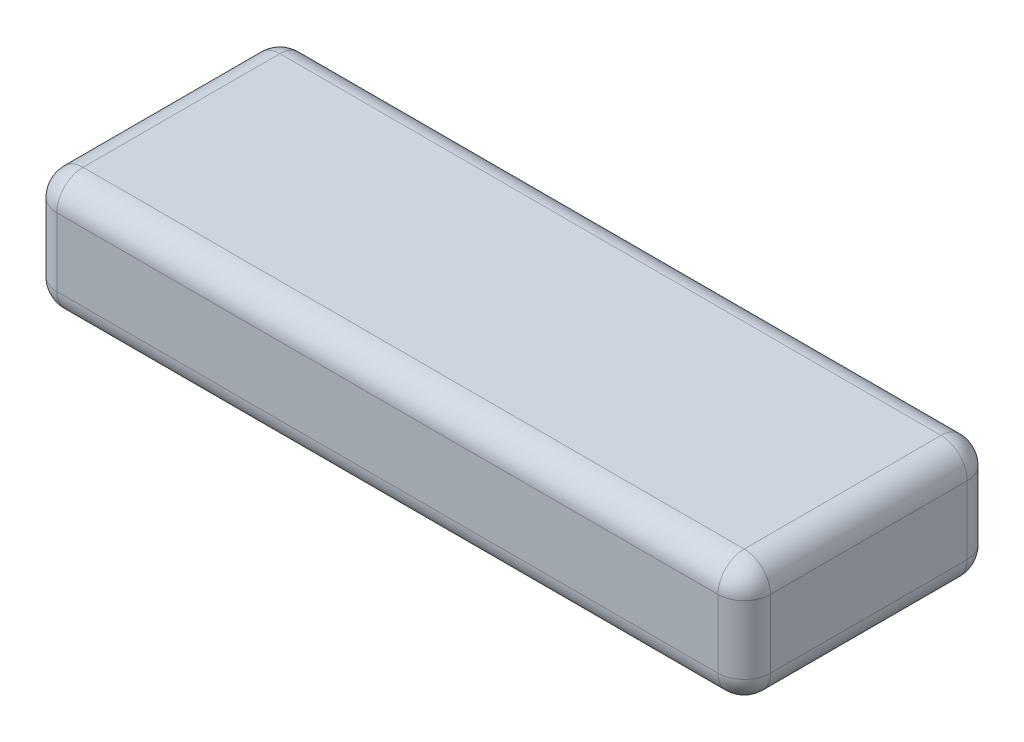
ISO-10303-21;
HEADER;
FILE_DESCRIPTION(('STEP AP214'),'2;1');
FILE_NAME('part.step','',(''),(''),'','','');
FILE_SCHEMA(('AUTOMOTIVE_DESIGN { 1 0 10303 214 1 1 1 1 }'));
ENDSEC;
DATA;
#1=APPLICATION_CONTEXT('core data for automotive mechanical design processes');
#2=APPLICATION_PROTOCOL_DEFINITION('international standard','automotive_design',2000,#1);
#3=PRODUCT_CONTEXT('',#1,'mechanical');
#4=PRODUCT('Part','Part','',(#3));
#5=PRODUCT_RELATED_PRODUCT_CATEGORY('part','',(#4));
#6=PRODUCT_DEFINITION_FORMATION('','',#4);
#7=PRODUCT_DEFINITION_CONTEXT('part definition',#1,'design');
#8=PRODUCT_DEFINITION('design','',#6,#7);
#9=PRODUCT_DEFINITION_SHAPE('','',#8);
#10=(LENGTH_UNIT() NAMED_UNIT(*) SI_UNIT(.MILLI.,.METRE.));
#11=(NAMED_UNIT(*) PLANE_ANGLE_UNIT() SI_UNIT($,.RADIAN.));
#12=(NAMED_UNIT(*) SI_UNIT($,.STERADIAN.) SOLID_ANGLE_UNIT());
#13=UNCERTAINTY_MEASURE_WITH_UNIT(LENGTH_MEASURE(1.E-05),#10,'distance_accuracy_value','');
#14=(GEOMETRIC_REPRESENTATION_CONTEXT(3) GLOBAL_UNCERTAINTY_ASSIGNED_CONTEXT((#13)) GLOBAL_UNIT_ASSIGNED_CONTEXT((#10,
#11,#12)) REPRESENTATION_CONTEXT('',''));
#15=CARTESIAN_POINT('',(0.,0.,0.));
#16=DIRECTION('',(0.,0.,1.));
#17=DIRECTION('',(1.,0.,0.));
#18=AXIS2_PLACEMENT_3D('',#15,#16,#17);
#19=CARTESIAN_POINT('',(-68.,23.,-23.75));
#20=DIRECTION('',(1.,0.,0.));
#21=DIRECTION('',(0.,0.,-1.));
#22=AXIS2_PLACEMENT_3D('',#19,#20,#21);
#23=PLANE('',#22);
#24=DIRECTION('',(0.,-1.,0.));
#25=VECTOR('',#24,1.);
#26=CARTESIAN_POINT('',(-68.,23.,-18.75));
#27=LINE('',#26,#25);
#28=CARTESIAN_POINT('',(-68.,18.,-18.75));
#29=VERTEX_POINT('',#28);
#30=CARTESIAN_POINT('',(-68.,5.,-18.75));
#31=VERTEX_POINT('',#30);
#32=EDGE_CURVE('E136',#29,#31,#27,.T.);
#33=ORIENTED_EDGE('',*,*,#32,.T.);
#34=DIRECTION('',(0.,0.,1.));
#35=VECTOR('',#34,1.);
#36=CARTESIAN_POINT('',(-68.,5.,-23.75));
#37=LINE('',#36,#35);
#38=CARTESIAN_POINT('',(-68.,5.,18.75));
#39=VERTEX_POINT('',#38);
#40=EDGE_CURVE('E132',#31,#39,#37,.T.);
#41=ORIENTED_EDGE('',*,*,#40,.T.);
#42=DIRECTION('',(0.,-1.,0.));
#43=VECTOR('',#42,1.);
#44=CARTESIAN_POINT('',(-68.,23.,18.75));
#45=LINE('',#44,#43);
#46=CARTESIAN_POINT('',(-68.,18.,18.75));
#47=VERTEX_POINT('',#46);
#48=EDGE_CURVE('E127',#39,#47,#45,.F.);
#49=ORIENTED_EDGE('',*,*,#48,.T.);
#50=DIRECTION('',(0.,0.,1.));
#51=VECTOR('',#50,1.);
#52=CARTESIAN_POINT('',(-68.,18.,-23.75));
#53=LINE('',#52,#51);
#54=EDGE_CURVE('E129',#47,#29,#53,.F.);
#55=ORIENTED_EDGE('',*,*,#54,.T.);
#56=EDGE_LOOP('',(#33,#41,#49,#55));
#57=FACE_BOUND('',#56,.T.);
#58=ADVANCED_FACE('F36',(#57),#23,.F.);
#59=CARTESIAN_POINT('',(-68.,23.,23.75));
#60=DIRECTION('',(0.,0.,-1.));
#61=DIRECTION('',(-1.,0.,0.));
#62=AXIS2_PLACEMENT_3D('',#59,#60,#61);
#63=PLANE('',#62);
#64=DIRECTION('',(1.,0.,0.));
#65=VECTOR('',#64,1.);
#66=CARTESIAN_POINT('',(-68.,18.,23.75));
#67=LINE('',#66,#65);
#68=CARTESIAN_POINT('',(63.,18.,23.75));
#69=VERTEX_POINT('',#68);
#70=CARTESIAN_POINT('',(-63.,18.,23.75));
#71=VERTEX_POINT('',#70);
#72=EDGE_CURVE('E232',#69,#71,#67,.F.);
#73=ORIENTED_EDGE('',*,*,#72,.T.);
#74=DIRECTION('',(0.,-1.,0.));
#75=VECTOR('',#74,1.);
#76=CARTESIAN_POINT('',(-63.,23.,23.75));
#77=LINE('',#76,#75);
#78=CARTESIAN_POINT('',(-63.,5.,23.75));
#79=VERTEX_POINT('',#78);
#80=EDGE_CURVE('E159',#71,#79,#77,.T.);
#81=ORIENTED_EDGE('',*,*,#80,.T.);
#82=DIRECTION('',(1.,0.,0.));
#83=VECTOR('',#82,1.);
#84=CARTESIAN_POINT('',(-68.,5.,23.75));
#85=LINE('',#84,#83);
#86=CARTESIAN_POINT('',(63.,5.,23.75));
#87=VERTEX_POINT('',#86);
#88=EDGE_CURVE('E236',#79,#87,#85,.T.);
#89=ORIENTED_EDGE('',*,*,#88,.T.);
#90=DIRECTION('',(0.,-1.,0.));
#91=VECTOR('',#90,1.);
#92=CARTESIAN_POINT('',(63.,23.,23.75));
#93=LINE('',#92,#91);
#94=EDGE_CURVE('E234',#87,#69,#93,.F.);
#95=ORIENTED_EDGE('',*,*,#94,.T.);
#96=EDGE_LOOP('',(#73,#81,#89,#95));
#97=FACE_BOUND('',#96,.T.);
#98=ADVANCED_FACE('F306',(#97),#63,.F.);
#99=CARTESIAN_POINT('',(68.,23.,-23.75));
#100=DIRECTION('',(-1.,0.,0.));
#101=DIRECTION('',(0.,0.,1.));
#102=AXIS2_PLACEMENT_3D('',#99,#100,#101);
#103=PLANE('',#102);
#104=DIRECTION('',(0.,-1.,0.));
#105=VECTOR('',#104,1.);
#106=CARTESIAN_POINT('',(68.,23.,18.75));
#107=LINE('',#106,#105);
#108=CARTESIAN_POINT('',(68.,18.,18.75));
#109=VERTEX_POINT('',#108);
#110=CARTESIAN_POINT('',(68.,5.,18.75));
#111=VERTEX_POINT('',#110);
#112=EDGE_CURVE('E241',#109,#111,#107,.T.);
#113=ORIENTED_EDGE('',*,*,#112,.T.);
#114=DIRECTION('',(0.,0.,-1.));
#115=VECTOR('',#114,1.);
#116=CARTESIAN_POINT('',(68.,5.,-23.75));
#117=LINE('',#116,#115);
#118=CARTESIAN_POINT('',(68.,5.,-18.75));
#119=VERTEX_POINT('',#118);
#120=EDGE_CURVE('E244',#111,#119,#117,.T.);
#121=ORIENTED_EDGE('',*,*,#120,.T.);
#122=DIRECTION('',(0.,-1.,0.));
#123=VECTOR('',#122,1.);
#124=CARTESIAN_POINT('',(68.,23.,-18.75));
#125=LINE('',#124,#123);
#126=CARTESIAN_POINT('',(68.,18.,-18.75));
#127=VERTEX_POINT('',#126);
#128=EDGE_CURVE('E216',#119,#127,#125,.F.);
#129=ORIENTED_EDGE('',*,*,#128,.T.);
#130=DIRECTION('',(0.,0.,-1.));
#131=VECTOR('',#130,1.);
#132=CARTESIAN_POINT('',(68.,18.,23.75));
#133=LINE('',#132,#131);
#134=EDGE_CURVE('E239',#127,#109,#133,.F.);
#135=ORIENTED_EDGE('',*,*,#134,.T.);
#136=EDGE_LOOP('',(#113,#121,#129,#135));
#137=FACE_BOUND('',#136,.T.);
#138=ADVANCED_FACE('F311',(#137),#103,.F.);
#139=CARTESIAN_POINT('',(-68.,23.,-23.75));
#140=DIRECTION('',(0.,0.,1.));
#141=DIRECTION('',(1.,0.,0.));
#142=AXIS2_PLACEMENT_3D('',#139,#140,#141);
#143=PLANE('',#142);
#144=DIRECTION('',(-1.,0.,0.));
#145=VECTOR('',#144,1.);
#146=CARTESIAN_POINT('',(-68.,5.,-23.75));
#147=LINE('',#146,#145);
#148=CARTESIAN_POINT('',(63.,5.,-23.75));
#149=VERTEX_POINT('',#148);
#150=CARTESIAN_POINT('',(-63.,5.,-23.75));
#151=VERTEX_POINT('',#150);
#152=EDGE_CURVE('E221',#149,#151,#147,.T.);
#153=ORIENTED_EDGE('',*,*,#152,.T.);
#154=DIRECTION('',(0.,-1.,0.));
#155=VECTOR('',#154,1.);
#156=CARTESIAN_POINT('',(-63.,23.,-23.75));
#157=LINE('',#156,#155);
#158=CARTESIAN_POINT('',(-63.,18.,-23.75));
#159=VERTEX_POINT('',#158);
#160=EDGE_CURVE('E224',#151,#159,#157,.F.);
#161=ORIENTED_EDGE('',*,*,#160,.T.);
#162=DIRECTION('',(-1.,0.,0.));
#163=VECTOR('',#162,1.);
#164=CARTESIAN_POINT('',(68.,18.,-23.75));
#165=LINE('',#164,#163);
#166=CARTESIAN_POINT('',(63.,18.,-23.75));
#167=VERTEX_POINT('',#166);
#168=EDGE_CURVE('E222',#159,#167,#165,.F.);
#169=ORIENTED_EDGE('',*,*,#168,.T.);
#170=DIRECTION('',(0.,-1.,0.));
#171=VECTOR('',#170,1.);
#172=CARTESIAN_POINT('',(63.,23.,-23.75));
#173=LINE('',#172,#171);
#174=EDGE_CURVE('E218',#167,#149,#173,.T.);
#175=ORIENTED_EDGE('',*,*,#174,.T.);
#176=EDGE_LOOP('',(#153,#161,#169,#175));
#177=FACE_BOUND('',#176,.T.);
#178=ADVANCED_FACE('F292',(#177),#143,.F.);
#179=CARTESIAN_POINT('',(0.,23.,0.));
#180=DIRECTION('',(0.,1.,0.));
#181=DIRECTION('',(0.,0.,1.));
#182=AXIS2_PLACEMENT_3D('',#179,#180,#181);
#183=PLANE('',#182);
#184=DIRECTION('',(1.,0.,0.));
#185=VECTOR('',#184,1.);
#186=CARTESIAN_POINT('',(68.,23.,18.75));
#187=LINE('',#186,#185);
#188=CARTESIAN_POINT('',(-63.,23.,18.75));
#189=VERTEX_POINT('',#188);
#190=CARTESIAN_POINT('',(63.,23.,18.75));
#191=VERTEX_POINT('',#190);
#192=EDGE_CURVE('E45',#189,#191,#187,.T.);
#193=ORIENTED_EDGE('',*,*,#192,.T.);
#194=DIRECTION('',(0.,0.,-1.));
#195=VECTOR('',#194,1.);
#196=CARTESIAN_POINT('',(63.,23.,-23.75));
#197=LINE('',#196,#195);
#198=CARTESIAN_POINT('',(63.,23.,-18.75));
#199=VERTEX_POINT('',#198);
#200=EDGE_CURVE('E11',#191,#199,#197,.T.);
#201=ORIENTED_EDGE('',*,*,#200,.T.);
#202=DIRECTION('',(-1.,0.,0.));
#203=VECTOR('',#202,1.);
#204=CARTESIAN_POINT('',(-68.,23.,-18.75));
#205=LINE('',#204,#203);
#206=CARTESIAN_POINT('',(-63.,23.,-18.75));
#207=VERTEX_POINT('',#206);
#208=EDGE_CURVE('E59',#199,#207,#205,.T.);
#209=ORIENTED_EDGE('',*,*,#208,.T.);
#210=DIRECTION('',(0.,0.,1.));
#211=VECTOR('',#210,1.);
#212=CARTESIAN_POINT('',(-63.,23.,23.75));
#213=LINE('',#212,#211);
#214=EDGE_CURVE('E246',#207,#189,#213,.T.);
#215=ORIENTED_EDGE('',*,*,#214,.T.);
#216=EDGE_LOOP('',(#193,#201,#209,#215));
#217=FACE_BOUND('',#216,.T.);
#218=ADVANCED_FACE('F371',(#217),#183,.T.);
#219=CARTESIAN_POINT('',(0.,0.,0.));
#220=DIRECTION('',(0.,1.,0.));
#221=DIRECTION('',(0.,0.,1.));
#222=AXIS2_PLACEMENT_3D('',#219,#220,#221);
#223=PLANE('',#222);
#224=DIRECTION('',(1.,0.,0.));
#225=VECTOR('',#224,1.);
#226=CARTESIAN_POINT('',(0.,0.,18.75));
#227=LINE('',#226,#225);
#228=CARTESIAN_POINT('',(63.,0.,18.75));
#229=VERTEX_POINT('',#228);
#230=CARTESIAN_POINT('',(-63.,0.,18.75));
#231=VERTEX_POINT('',#230);
#232=EDGE_CURVE('E275',#229,#231,#227,.F.);
#233=ORIENTED_EDGE('',*,*,#232,.T.);
#234=DIRECTION('',(0.,0.,1.));
#235=VECTOR('',#234,1.);
#236=CARTESIAN_POINT('',(-63.,0.,0.));
#237=LINE('',#236,#235);
#238=CARTESIAN_POINT('',(-63.,0.,-18.75));
#239=VERTEX_POINT('',#238);
#240=EDGE_CURVE('E226',#231,#239,#237,.F.);
#241=ORIENTED_EDGE('',*,*,#240,.T.);
#242=DIRECTION('',(-1.,0.,0.));
#243=VECTOR('',#242,1.);
#244=CARTESIAN_POINT('',(0.,0.,-18.75));
#245=LINE('',#244,#243);
#246=CARTESIAN_POINT('',(63.,0.,-18.75));
#247=VERTEX_POINT('',#246);
#248=EDGE_CURVE('E270',#239,#247,#245,.F.);
#249=ORIENTED_EDGE('',*,*,#248,.T.);
#250=DIRECTION('',(0.,0.,-1.));
#251=VECTOR('',#250,1.);
#252=CARTESIAN_POINT('',(63.,0.,0.));
#253=LINE('',#252,#251);
#254=EDGE_CURVE('E285',#247,#229,#253,.F.);
#255=ORIENTED_EDGE('',*,*,#254,.T.);
#256=EDGE_LOOP('',(#233,#241,#249,#255));
#257=FACE_BOUND('',#256,.T.);
#258=ADVANCED_FACE('F278',(#257),#223,.F.);
#259=CARTESIAN_POINT('',(63.,18.,0.));
#260=DIRECTION('',(0.,0.,1.));
#261=DIRECTION('',(1.,0.,0.));
#262=AXIS2_PLACEMENT_3D('',#259,#260,#261);
#263=CYLINDRICAL_SURFACE('',#262,5.);
#264=CARTESIAN_POINT('',(63.,18.,-18.75));
#265=DIRECTION('',(0.,0.,-1.));
#266=DIRECTION('',(-1.,0.,0.));
#267=AXIS2_PLACEMENT_3D('',#264,#265,#266);
#268=CIRCLE('',#267,5.);
#269=EDGE_CURVE('E40',#199,#127,#268,.T.);
#270=ORIENTED_EDGE('',*,*,#269,.F.);
#271=ORIENTED_EDGE('',*,*,#200,.F.);
#272=CARTESIAN_POINT('',(63.,18.,18.75));
#273=DIRECTION('',(0.,0.,1.));
#274=DIRECTION('',(0.,-1.,0.));
#275=AXIS2_PLACEMENT_3D('',#272,#273,#274);
#276=CIRCLE('',#275,5.);
#277=EDGE_CURVE('E198',#109,#191,#276,.T.);
#278=ORIENTED_EDGE('',*,*,#277,.F.);
#279=ORIENTED_EDGE('',*,*,#134,.F.);
#280=EDGE_LOOP('',(#270,#271,#278,#279));
#281=FACE_BOUND('',#280,.T.);
#282=ADVANCED_FACE('F38',(#281),#263,.T.);
#283=CARTESIAN_POINT('',(63.,18.,-18.75));
#284=DIRECTION('',(0.,0.,1.));
#285=DIRECTION('',(1.,0.,0.));
#286=AXIS2_PLACEMENT_3D('',#283,#284,#285);
#287=SPHERICAL_SURFACE('',#286,5.);
#288=CARTESIAN_POINT('',(63.,18.,-18.75));
#289=DIRECTION('',(1.,0.,0.));
#290=DIRECTION('',(0.,0.,-1.));
#291=AXIS2_PLACEMENT_3D('',#288,#289,#290);
#292=CIRCLE('',#291,5.);
#293=EDGE_CURVE('E194',#199,#167,#292,.F.);
#294=ORIENTED_EDGE('',*,*,#293,.F.);
#295=ORIENTED_EDGE('',*,*,#269,.T.);
#296=CARTESIAN_POINT('',(63.,18.,-18.75));
#297=DIRECTION('',(0.,1.,0.));
#298=DIRECTION('',(0.,0.,1.));
#299=AXIS2_PLACEMENT_3D('',#296,#297,#298);
#300=CIRCLE('',#299,5.);
#301=EDGE_CURVE('E196',#167,#127,#300,.F.);
#302=ORIENTED_EDGE('',*,*,#301,.F.);
#303=EDGE_LOOP('',(#294,#295,#302));
#304=FACE_BOUND('',#303,.T.);
#305=ADVANCED_FACE('F208',(#304),#287,.T.);
#306=CARTESIAN_POINT('',(63.,18.,18.75));
#307=DIRECTION('',(0.,0.,1.));
#308=DIRECTION('',(1.,0.,0.));
#309=AXIS2_PLACEMENT_3D('',#306,#307,#308);
#310=SPHERICAL_SURFACE('',#309,5.);
#311=CARTESIAN_POINT('',(63.,18.,18.75));
#312=DIRECTION('',(0.,1.,0.));
#313=DIRECTION('',(0.,0.,1.));
#314=AXIS2_PLACEMENT_3D('',#311,#312,#313);
#315=CIRCLE('',#314,5.);
#316=EDGE_CURVE('E188',#109,#69,#315,.F.);
#317=ORIENTED_EDGE('',*,*,#316,.F.);
#318=ORIENTED_EDGE('',*,*,#277,.T.);
#319=CARTESIAN_POINT('',(63.,18.,18.75));
#320=DIRECTION('',(1.,0.,0.));
#321=DIRECTION('',(0.,0.,-1.));
#322=AXIS2_PLACEMENT_3D('',#319,#320,#321);
#323=CIRCLE('',#322,5.);
#324=EDGE_CURVE('E191',#69,#191,#323,.F.);
#325=ORIENTED_EDGE('',*,*,#324,.F.);
#326=EDGE_LOOP('',(#317,#318,#325));
#327=FACE_BOUND('',#326,.T.);
#328=ADVANCED_FACE('F303',(#327),#310,.T.);
#329=CARTESIAN_POINT('',(63.,23.,-18.75));
#330=DIRECTION('',(0.,-1.,0.));
#331=DIRECTION('',(0.,0.,-1.));
#332=AXIS2_PLACEMENT_3D('',#329,#330,#331);
#333=CYLINDRICAL_SURFACE('',#332,5.);
#334=ORIENTED_EDGE('',*,*,#301,.T.);
#335=ORIENTED_EDGE('',*,*,#128,.F.);
#336=CARTESIAN_POINT('',(63.,5.,-18.75));
#337=DIRECTION('',(0.,-1.,0.));
#338=DIRECTION('',(0.,0.,-1.));
#339=AXIS2_PLACEMENT_3D('',#336,#337,#338);
#340=CIRCLE('',#339,5.);
#341=EDGE_CURVE('E183',#149,#119,#340,.T.);
#342=ORIENTED_EDGE('',*,*,#341,.F.);
#343=ORIENTED_EDGE('',*,*,#174,.F.);
#344=EDGE_LOOP('',(#334,#335,#342,#343));
#345=FACE_BOUND('',#344,.T.);
#346=ADVANCED_FACE('F214',(#345),#333,.T.);
#347=CARTESIAN_POINT('',(0.,18.,-18.75));
#348=DIRECTION('',(1.,0.,0.));
#349=DIRECTION('',(0.,0.,-1.));
#350=AXIS2_PLACEMENT_3D('',#347,#348,#349);
#351=CYLINDRICAL_SURFACE('',#350,5.);
#352=ORIENTED_EDGE('',*,*,#293,.T.);
#353=ORIENTED_EDGE('',*,*,#168,.F.);
#354=CARTESIAN_POINT('',(-63.,18.,-18.75));
#355=DIRECTION('',(-1.,0.,0.));
#356=DIRECTION('',(0.,0.,1.));
#357=AXIS2_PLACEMENT_3D('',#354,#355,#356);
#358=CIRCLE('',#357,5.);
#359=EDGE_CURVE('E180',#207,#159,#358,.T.);
#360=ORIENTED_EDGE('',*,*,#359,.F.);
#361=ORIENTED_EDGE('',*,*,#208,.F.);
#362=EDGE_LOOP('',(#352,#353,#360,#361));
#363=FACE_BOUND('',#362,.T.);
#364=ADVANCED_FACE('F294',(#363),#351,.T.);
#365=CARTESIAN_POINT('',(-63.,18.,0.));
#366=DIRECTION('',(0.,0.,-1.));
#367=DIRECTION('',(-1.,0.,0.));
#368=AXIS2_PLACEMENT_3D('',#365,#366,#367);
#369=CYLINDRICAL_SURFACE('',#368,5.);
#370=CARTESIAN_POINT('',(-63.,18.,18.75));
#371=DIRECTION('',(0.,0.,1.));
#372=DIRECTION('',(1.,0.,0.));
#373=AXIS2_PLACEMENT_3D('',#370,#371,#372);
#374=CIRCLE('',#373,5.);
#375=EDGE_CURVE('E143',#189,#47,#374,.T.);
#376=ORIENTED_EDGE('',*,*,#375,.F.);
#377=ORIENTED_EDGE('',*,*,#214,.F.);
#378=CARTESIAN_POINT('',(-63.,18.,-18.75));
#379=DIRECTION('',(0.,0.,-1.));
#380=DIRECTION('',(-1.,0.,0.));
#381=AXIS2_PLACEMENT_3D('',#378,#379,#380);
#382=CIRCLE('',#381,5.);
#383=EDGE_CURVE('E146',#29,#207,#382,.T.);
#384=ORIENTED_EDGE('',*,*,#383,.F.);
#385=ORIENTED_EDGE('',*,*,#54,.F.);
#386=EDGE_LOOP('',(#376,#377,#384,#385));
#387=FACE_BOUND('',#386,.T.);
#388=ADVANCED_FACE('F141',(#387),#369,.T.);
#389=CARTESIAN_POINT('',(0.,18.,18.75));
#390=DIRECTION('',(-1.,0.,0.));
#391=DIRECTION('',(0.,0.,1.));
#392=AXIS2_PLACEMENT_3D('',#389,#390,#391);
#393=CYLINDRICAL_SURFACE('',#392,5.);
#394=ORIENTED_EDGE('',*,*,#324,.T.);
#395=ORIENTED_EDGE('',*,*,#192,.F.);
#396=CARTESIAN_POINT('',(-63.,18.,18.75));
#397=DIRECTION('',(-1.,0.,0.));
#398=DIRECTION('',(0.,0.,1.));
#399=AXIS2_PLACEMENT_3D('',#396,#397,#398);
#400=CIRCLE('',#399,5.);
#401=EDGE_CURVE('E155',#71,#189,#400,.T.);
#402=ORIENTED_EDGE('',*,*,#401,.F.);
#403=ORIENTED_EDGE('',*,*,#72,.F.);
#404=EDGE_LOOP('',(#394,#395,#402,#403));
#405=FACE_BOUND('',#404,.T.);
#406=ADVANCED_FACE('F301',(#405),#393,.T.);
#407=CARTESIAN_POINT('',(63.,23.,18.75));
#408=DIRECTION('',(0.,-1.,0.));
#409=DIRECTION('',(0.,0.,-1.));
#410=AXIS2_PLACEMENT_3D('',#407,#408,#409);
#411=CYLINDRICAL_SURFACE('',#410,5.);
#412=ORIENTED_EDGE('',*,*,#316,.T.);
#413=ORIENTED_EDGE('',*,*,#94,.F.);
#414=CARTESIAN_POINT('',(63.,5.,18.75));
#415=DIRECTION('',(0.,-1.,0.));
#416=DIRECTION('',(0.,0.,-1.));
#417=AXIS2_PLACEMENT_3D('',#414,#415,#416);
#418=CIRCLE('',#417,5.);
#419=EDGE_CURVE('E175',#111,#87,#418,.T.);
#420=ORIENTED_EDGE('',*,*,#419,.F.);
#421=ORIENTED_EDGE('',*,*,#112,.F.);
#422=EDGE_LOOP('',(#412,#413,#420,#421));
#423=FACE_BOUND('',#422,.T.);
#424=ADVANCED_FACE('F352',(#423),#411,.T.);
#425=CARTESIAN_POINT('',(63.,5.,-23.75));
#426=DIRECTION('',(0.,0.,-1.));
#427=DIRECTION('',(-1.,0.,0.));
#428=AXIS2_PLACEMENT_3D('',#425,#426,#427);
#429=CYLINDRICAL_SURFACE('',#428,5.);
#430=CARTESIAN_POINT('',(63.,5.,-18.75));
#431=DIRECTION('',(0.,0.,-1.));
#432=DIRECTION('',(-1.,0.,0.));
#433=AXIS2_PLACEMENT_3D('',#430,#431,#432);
#434=CIRCLE('',#433,5.);
#435=EDGE_CURVE('E185',#119,#247,#434,.T.);
#436=ORIENTED_EDGE('',*,*,#435,.F.);
#437=ORIENTED_EDGE('',*,*,#120,.F.);
#438=CARTESIAN_POINT('',(63.,5.,18.75));
#439=DIRECTION('',(0.,0.,1.));
#440=DIRECTION('',(1.,0.,0.));
#441=AXIS2_PLACEMENT_3D('',#438,#439,#440);
#442=CIRCLE('',#441,5.);
#443=EDGE_CURVE('E172',#229,#111,#442,.T.);
#444=ORIENTED_EDGE('',*,*,#443,.F.);
#445=ORIENTED_EDGE('',*,*,#254,.F.);
#446=EDGE_LOOP('',(#436,#437,#444,#445));
#447=FACE_BOUND('',#446,.T.);
#448=ADVANCED_FACE('F348',(#447),#429,.T.);
#449=CARTESIAN_POINT('',(63.,5.,-18.75));
#450=DIRECTION('',(0.,0.,1.));
#451=DIRECTION('',(1.,0.,0.));
#452=AXIS2_PLACEMENT_3D('',#449,#450,#451);
#453=SPHERICAL_SURFACE('',#452,5.);
#454=ORIENTED_EDGE('',*,*,#341,.T.);
#455=ORIENTED_EDGE('',*,*,#435,.T.);
#456=CARTESIAN_POINT('',(63.,5.,-18.75));
#457=DIRECTION('',(1.,0.,0.));
#458=DIRECTION('',(0.,0.,-1.));
#459=AXIS2_PLACEMENT_3D('',#456,#457,#458);
#460=CIRCLE('',#459,5.);
#461=EDGE_CURVE('E163',#149,#247,#460,.F.);
#462=ORIENTED_EDGE('',*,*,#461,.F.);
#463=EDGE_LOOP('',(#454,#455,#462));
#464=FACE_BOUND('',#463,.T.);
#465=ADVANCED_FACE('F344',(#464),#453,.T.);
#466=CARTESIAN_POINT('',(-63.,18.,-18.75));
#467=DIRECTION('',(0.,0.,1.));
#468=DIRECTION('',(1.,0.,0.));
#469=AXIS2_PLACEMENT_3D('',#466,#467,#468);
#470=SPHERICAL_SURFACE('',#469,5.);
#471=ORIENTED_EDGE('',*,*,#383,.T.);
#472=ORIENTED_EDGE('',*,*,#359,.T.);
#473=CARTESIAN_POINT('',(-63.,18.,-18.75));
#474=DIRECTION('',(0.,1.,0.));
#475=DIRECTION('',(0.,0.,1.));
#476=AXIS2_PLACEMENT_3D('',#473,#474,#475);
#477=CIRCLE('',#476,5.);
#478=EDGE_CURVE('E160',#29,#159,#477,.F.);
#479=ORIENTED_EDGE('',*,*,#478,.F.);
#480=EDGE_LOOP('',(#471,#472,#479));
#481=FACE_BOUND('',#480,.T.);
#482=ADVANCED_FACE('F341',(#481),#470,.T.);
#483=CARTESIAN_POINT('',(-63.,18.,18.75));
#484=DIRECTION('',(0.,0.,1.));
#485=DIRECTION('',(1.,0.,0.));
#486=AXIS2_PLACEMENT_3D('',#483,#484,#485);
#487=SPHERICAL_SURFACE('',#486,5.);
#488=ORIENTED_EDGE('',*,*,#401,.T.);
#489=ORIENTED_EDGE('',*,*,#375,.T.);
#490=CARTESIAN_POINT('',(-63.,18.,18.75));
#491=DIRECTION('',(0.,1.,0.));
#492=DIRECTION('',(0.,0.,1.));
#493=AXIS2_PLACEMENT_3D('',#490,#491,#492);
#494=CIRCLE('',#493,5.);
#495=EDGE_CURVE('E152',#71,#47,#494,.F.);
#496=ORIENTED_EDGE('',*,*,#495,.F.);
#497=EDGE_LOOP('',(#488,#489,#496));
#498=FACE_BOUND('',#497,.T.);
#499=ADVANCED_FACE('F151',(#498),#487,.T.);
#500=CARTESIAN_POINT('',(63.,5.,18.75));
#501=DIRECTION('',(0.,0.,1.));
#502=DIRECTION('',(1.,0.,0.));
#503=AXIS2_PLACEMENT_3D('',#500,#501,#502);
#504=SPHERICAL_SURFACE('',#503,5.);
#505=ORIENTED_EDGE('',*,*,#443,.T.);
#506=ORIENTED_EDGE('',*,*,#419,.T.);
#507=CARTESIAN_POINT('',(63.,5.,18.75));
#508=DIRECTION('',(1.,0.,0.));
#509=DIRECTION('',(0.,0.,-1.));
#510=AXIS2_PLACEMENT_3D('',#507,#508,#509);
#511=CIRCLE('',#510,5.);
#512=EDGE_CURVE('E161',#229,#87,#511,.F.);
#513=ORIENTED_EDGE('',*,*,#512,.F.);
#514=EDGE_LOOP('',(#505,#506,#513));
#515=FACE_BOUND('',#514,.T.);
#516=ADVANCED_FACE('F335',(#515),#504,.T.);
#517=CARTESIAN_POINT('',(-68.,5.,-18.75));
#518=DIRECTION('',(-1.,0.,0.));
#519=DIRECTION('',(0.,0.,1.));
#520=AXIS2_PLACEMENT_3D('',#517,#518,#519);
#521=CYLINDRICAL_SURFACE('',#520,5.);
#522=ORIENTED_EDGE('',*,*,#461,.T.);
#523=ORIENTED_EDGE('',*,*,#248,.F.);
#524=CARTESIAN_POINT('',(-63.,5.,-18.75));
#525=DIRECTION('',(-1.,0.,0.));
#526=DIRECTION('',(0.,0.,1.));
#527=AXIS2_PLACEMENT_3D('',#524,#525,#526);
#528=CIRCLE('',#527,5.);
#529=EDGE_CURVE('E166',#151,#239,#528,.T.);
#530=ORIENTED_EDGE('',*,*,#529,.F.);
#531=ORIENTED_EDGE('',*,*,#152,.F.);
#532=EDGE_LOOP('',(#522,#523,#530,#531));
#533=FACE_BOUND('',#532,.T.);
#534=ADVANCED_FACE('F272',(#533),#521,.T.);
#535=CARTESIAN_POINT('',(-63.,23.,-18.75));
#536=DIRECTION('',(0.,-1.,0.));
#537=DIRECTION('',(0.,0.,-1.));
#538=AXIS2_PLACEMENT_3D('',#535,#536,#537);
#539=CYLINDRICAL_SURFACE('',#538,5.);
#540=ORIENTED_EDGE('',*,*,#478,.T.);
#541=ORIENTED_EDGE('',*,*,#160,.F.);
#542=CARTESIAN_POINT('',(-63.,5.,-18.75));
#543=DIRECTION('',(0.,-1.,0.));
#544=DIRECTION('',(0.,0.,-1.));
#545=AXIS2_PLACEMENT_3D('',#542,#543,#544);
#546=CIRCLE('',#545,5.);
#547=EDGE_CURVE('E259',#31,#151,#546,.T.);
#548=ORIENTED_EDGE('',*,*,#547,.F.);
#549=ORIENTED_EDGE('',*,*,#32,.F.);
#550=EDGE_LOOP('',(#540,#541,#548,#549));
#551=FACE_BOUND('',#550,.T.);
#552=ADVANCED_FACE('F291',(#551),#539,.T.);
#553=CARTESIAN_POINT('',(-63.,23.,18.75));
#554=DIRECTION('',(0.,-1.,0.));
#555=DIRECTION('',(0.,0.,-1.));
#556=AXIS2_PLACEMENT_3D('',#553,#554,#555);
#557=CYLINDRICAL_SURFACE('',#556,5.);
#558=ORIENTED_EDGE('',*,*,#495,.T.);
#559=ORIENTED_EDGE('',*,*,#48,.F.);
#560=CARTESIAN_POINT('',(-63.,5.,18.75));
#561=DIRECTION('',(0.,-1.,0.));
#562=DIRECTION('',(0.,0.,-1.));
#563=AXIS2_PLACEMENT_3D('',#560,#561,#562);
#564=CIRCLE('',#563,5.);
#565=EDGE_CURVE('E256',#79,#39,#564,.T.);
#566=ORIENTED_EDGE('',*,*,#565,.F.);
#567=ORIENTED_EDGE('',*,*,#80,.F.);
#568=EDGE_LOOP('',(#558,#559,#566,#567));
#569=FACE_BOUND('',#568,.T.);
#570=ADVANCED_FACE('F157',(#569),#557,.T.);
#571=CARTESIAN_POINT('',(-68.,5.,18.75));
#572=DIRECTION('',(1.,0.,0.));
#573=DIRECTION('',(0.,0.,-1.));
#574=AXIS2_PLACEMENT_3D('',#571,#572,#573);
#575=CYLINDRICAL_SURFACE('',#574,5.);
#576=ORIENTED_EDGE('',*,*,#512,.T.);
#577=ORIENTED_EDGE('',*,*,#88,.F.);
#578=CARTESIAN_POINT('',(-63.,5.,18.75));
#579=DIRECTION('',(-1.,0.,0.));
#580=DIRECTION('',(0.,0.,1.));
#581=AXIS2_PLACEMENT_3D('',#578,#579,#580);
#582=CIRCLE('',#581,5.);
#583=EDGE_CURVE('E254',#231,#79,#582,.T.);
#584=ORIENTED_EDGE('',*,*,#583,.F.);
#585=ORIENTED_EDGE('',*,*,#232,.F.);
#586=EDGE_LOOP('',(#576,#577,#584,#585));
#587=FACE_BOUND('',#586,.T.);
#588=ADVANCED_FACE('F325',(#587),#575,.T.);
#589=CARTESIAN_POINT('',(-63.,5.,-18.75));
#590=DIRECTION('',(0.,0.,1.));
#591=DIRECTION('',(1.,0.,0.));
#592=AXIS2_PLACEMENT_3D('',#589,#590,#591);
#593=SPHERICAL_SURFACE('',#592,5.);
#594=ORIENTED_EDGE('',*,*,#547,.T.);
#595=ORIENTED_EDGE('',*,*,#529,.T.);
#596=CARTESIAN_POINT('',(-63.,5.,-18.75));
#597=DIRECTION('',(0.,0.,-1.));
#598=DIRECTION('',(-1.,0.,0.));
#599=AXIS2_PLACEMENT_3D('',#596,#597,#598);
#600=CIRCLE('',#599,5.);
#601=EDGE_CURVE('E252',#31,#239,#600,.F.);
#602=ORIENTED_EDGE('',*,*,#601,.F.);
#603=EDGE_LOOP('',(#594,#595,#602));
#604=FACE_BOUND('',#603,.T.);
#605=ADVANCED_FACE('F266',(#604),#593,.T.);
#606=CARTESIAN_POINT('',(-63.,5.,18.75));
#607=DIRECTION('',(0.,0.,1.));
#608=DIRECTION('',(1.,0.,0.));
#609=AXIS2_PLACEMENT_3D('',#606,#607,#608);
#610=SPHERICAL_SURFACE('',#609,5.);
#611=ORIENTED_EDGE('',*,*,#583,.T.);
#612=ORIENTED_EDGE('',*,*,#565,.T.);
#613=CARTESIAN_POINT('',(-63.,5.,18.75));
#614=DIRECTION('',(0.,0.,1.));
#615=DIRECTION('',(1.,0.,0.));
#616=AXIS2_PLACEMENT_3D('',#613,#614,#615);
#617=CIRCLE('',#616,5.);
#618=EDGE_CURVE('E250',#231,#39,#617,.F.);
#619=ORIENTED_EDGE('',*,*,#618,.F.);
#620=EDGE_LOOP('',(#611,#612,#619));
#621=FACE_BOUND('',#620,.T.);
#622=ADVANCED_FACE('F319',(#621),#610,.T.);
#623=CARTESIAN_POINT('',(-63.,5.,-23.75));
#624=DIRECTION('',(0.,0.,1.));
#625=DIRECTION('',(1.,0.,0.));
#626=AXIS2_PLACEMENT_3D('',#623,#624,#625);
#627=CYLINDRICAL_SURFACE('',#626,5.);
#628=ORIENTED_EDGE('',*,*,#601,.T.);
#629=ORIENTED_EDGE('',*,*,#240,.F.);
#630=ORIENTED_EDGE('',*,*,#618,.T.);
#631=ORIENTED_EDGE('',*,*,#40,.F.);
#632=EDGE_LOOP('',(#628,#629,#630,#631));
#633=FACE_BOUND('',#632,.T.);
#634=ADVANCED_FACE('F316',(#633),#627,.T.);
#635=CLOSED_SHELL('',(#58,#98,#138,#178,#218,#258,#282,#305,#328,#346,#364,#388,#406,#424,#448,
#465,#482,#499,#516,#534,#552,#570,#588,#605,#622,#634));
#636=MANIFOLD_SOLID_BREP('B2',#635);
#637=ADVANCED_BREP_SHAPE_REPRESENTATION('',(#18,#636),#14);
#638=SHAPE_DEFINITION_REPRESENTATION(#9,#637);
ENDSEC;
END-ISO-10303-21;
